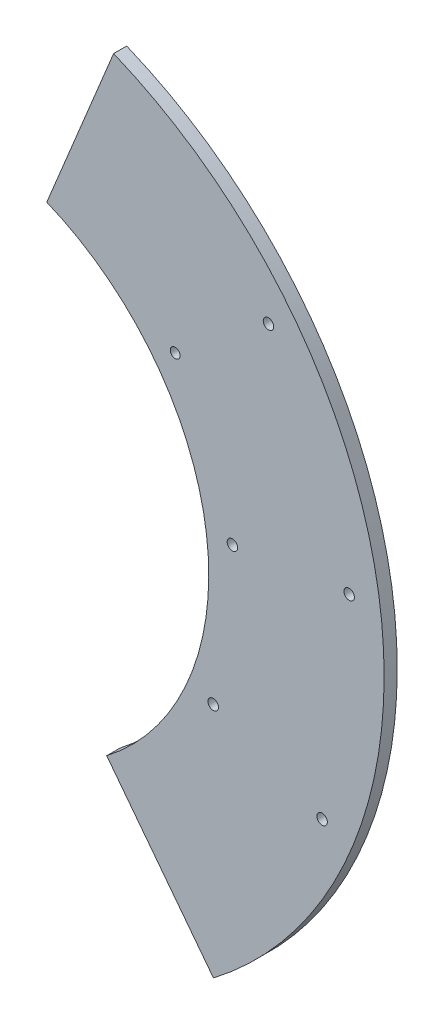
ISO-10303-21;
HEADER;
FILE_DESCRIPTION(('STEP AP214'),'2;1');
FILE_NAME('part.step','',(''),(''),'','','');
FILE_SCHEMA(('AUTOMOTIVE_DESIGN { 1 0 10303 214 1 1 1 1 }'));
ENDSEC;
DATA;
#1=APPLICATION_CONTEXT('core data for automotive mechanical design processes');
#2=APPLICATION_PROTOCOL_DEFINITION('international standard','automotive_design',2000,#1);
#3=PRODUCT_CONTEXT('',#1,'mechanical');
#4=PRODUCT('Part','Part','',(#3));
#5=PRODUCT_RELATED_PRODUCT_CATEGORY('part','',(#4));
#6=PRODUCT_DEFINITION_FORMATION('','',#4);
#7=PRODUCT_DEFINITION_CONTEXT('part definition',#1,'design');
#8=PRODUCT_DEFINITION('design','',#6,#7);
#9=PRODUCT_DEFINITION_SHAPE('','',#8);
#10=(LENGTH_UNIT() NAMED_UNIT(*) SI_UNIT(.MILLI.,.METRE.));
#11=(NAMED_UNIT(*) PLANE_ANGLE_UNIT() SI_UNIT($,.RADIAN.));
#12=(NAMED_UNIT(*) SI_UNIT($,.STERADIAN.) SOLID_ANGLE_UNIT());
#13=UNCERTAINTY_MEASURE_WITH_UNIT(LENGTH_MEASURE(1.E-05),#10,'distance_accuracy_value','');
#14=(GEOMETRIC_REPRESENTATION_CONTEXT(3) GLOBAL_UNCERTAINTY_ASSIGNED_CONTEXT((#13)) GLOBAL_UNIT_ASSIGNED_CONTEXT((#10,
#11,#12)) REPRESENTATION_CONTEXT('',''));
#15=CARTESIAN_POINT('',(0.,0.,0.));
#16=DIRECTION('',(0.,0.,1.));
#17=DIRECTION('',(1.,0.,0.));
#18=AXIS2_PLACEMENT_3D('',#15,#16,#17);
#19=CARTESIAN_POINT('',(0.,0.,5.));
#20=DIRECTION('',(0.,0.,-1.));
#21=DIRECTION('',(-1.,0.,0.));
#22=AXIS2_PLACEMENT_3D('',#19,#20,#21);
#23=CYLINDRICAL_SURFACE('',#22,100.);
#24=DIRECTION('',(0.,0.,1.));
#25=VECTOR('',#24,1.);
#26=CARTESIAN_POINT('',(61.0094832088441,-79.232840152236,-5.));
#27=LINE('',#26,#25);
#28=CARTESIAN_POINT('',(61.0094832088441,-79.232840152236,0.));
#29=VERTEX_POINT('',#28);
#30=CARTESIAN_POINT('',(61.0094832088441,-79.232840152236,5.));
#31=VERTEX_POINT('',#30);
#32=EDGE_CURVE('E91',#29,#31,#27,.T.);
#33=ORIENTED_EDGE('',*,*,#32,.T.);
#34=CARTESIAN_POINT('',(0.,0.,5.));
#35=DIRECTION('',(0.,0.,1.));
#36=DIRECTION('',(1.,0.,0.));
#37=AXIS2_PLACEMENT_3D('',#34,#35,#36);
#38=CIRCLE('',#37,100.);
#39=CARTESIAN_POINT('',(38.1129107813878,92.4521824067446,5.));
#40=VERTEX_POINT('',#39);
#41=EDGE_CURVE('E90',#31,#40,#38,.T.);
#42=ORIENTED_EDGE('',*,*,#41,.T.);
#43=DIRECTION('',(0.,0.,1.));
#44=VECTOR('',#43,1.);
#45=CARTESIAN_POINT('',(38.1129107813878,92.4521824067446,-5.));
#46=LINE('',#45,#44);
#47=CARTESIAN_POINT('',(38.1129107813878,92.4521824067446,0.));
#48=VERTEX_POINT('',#47);
#49=EDGE_CURVE('E140',#48,#40,#46,.T.);
#50=ORIENTED_EDGE('',*,*,#49,.F.);
#51=CARTESIAN_POINT('',(0.,0.,0.));
#52=DIRECTION('',(0.,0.,1.));
#53=DIRECTION('',(1.,0.,0.));
#54=AXIS2_PLACEMENT_3D('',#51,#52,#53);
#55=CIRCLE('',#54,100.);
#56=EDGE_CURVE('E81',#29,#48,#55,.T.);
#57=ORIENTED_EDGE('',*,*,#56,.F.);
#58=EDGE_LOOP('',(#33,#42,#50,#57));
#59=FACE_BOUND('',#58,.T.);
#60=ADVANCED_FACE('F34',(#59),#23,.F.);
#61=CARTESIAN_POINT('',(0.,0.,5.));
#62=DIRECTION('',(0.,0.,-1.));
#63=DIRECTION('',(-1.,0.,0.));
#64=AXIS2_PLACEMENT_3D('',#61,#62,#63);
#65=CYLINDRICAL_SURFACE('',#64,167.);
#66=CARTESIAN_POINT('',(0.,0.,0.));
#67=DIRECTION('',(0.,0.,1.));
#68=DIRECTION('',(1.,0.,0.));
#69=AXIS2_PLACEMENT_3D('',#66,#67,#68);
#70=CIRCLE('',#69,167.);
#71=CARTESIAN_POINT('',(101.798321541105,-132.38618406546,0.));
#72=VERTEX_POINT('',#71);
#73=CARTESIAN_POINT('',(63.6485610049175,154.395144619264,0.));
#74=VERTEX_POINT('',#73);
#75=EDGE_CURVE('E94',#72,#74,#70,.T.);
#76=ORIENTED_EDGE('',*,*,#75,.T.);
#77=DIRECTION('',(0.,0.,1.));
#78=VECTOR('',#77,1.);
#79=CARTESIAN_POINT('',(63.6485610049175,154.395144619264,-5.));
#80=LINE('',#79,#78);
#81=CARTESIAN_POINT('',(63.6485610049175,154.395144619264,5.));
#82=VERTEX_POINT('',#81);
#83=EDGE_CURVE('E50',#74,#82,#80,.T.);
#84=ORIENTED_EDGE('',*,*,#83,.T.);
#85=CARTESIAN_POINT('',(0.,0.,5.));
#86=DIRECTION('',(0.,0.,1.));
#87=DIRECTION('',(1.,0.,0.));
#88=AXIS2_PLACEMENT_3D('',#85,#86,#87);
#89=CIRCLE('',#88,167.);
#90=CARTESIAN_POINT('',(101.798321541105,-132.38618406546,5.));
#91=VERTEX_POINT('',#90);
#92=EDGE_CURVE('E89',#91,#82,#89,.T.);
#93=ORIENTED_EDGE('',*,*,#92,.F.);
#94=DIRECTION('',(0.,0.,1.));
#95=VECTOR('',#94,1.);
#96=CARTESIAN_POINT('',(101.798321541105,-132.38618406546,-5.));
#97=LINE('',#96,#95);
#98=EDGE_CURVE('E42',#72,#91,#97,.T.);
#99=ORIENTED_EDGE('',*,*,#98,.F.);
#100=EDGE_LOOP('',(#76,#84,#93,#99));
#101=FACE_BOUND('',#100,.T.);
#102=ADVANCED_FACE('F93',(#101),#65,.T.);
#103=CARTESIAN_POINT('',(0.,0.,5.));
#104=DIRECTION('',(0.,0.,1.));
#105=DIRECTION('',(1.,0.,0.));
#106=AXIS2_PLACEMENT_3D('',#103,#104,#105);
#107=PLANE('',#106);
#108=DIRECTION('',(-0.608788136708084,0.79333284603847,0.));
#109=VECTOR('',#108,1.);
#110=CARTESIAN_POINT('',(61.0094832088441,-79.232840152236,5.));
#111=LINE('',#110,#109);
#112=EDGE_CURVE('E75',#91,#31,#111,.T.);
#113=ORIENTED_EDGE('',*,*,#112,.F.);
#114=ORIENTED_EDGE('',*,*,#92,.T.);
#115=DIRECTION('',(0.381129107813877,0.924521824067447,0.));
#116=VECTOR('',#115,1.);
#117=CARTESIAN_POINT('',(0.,0.,5.));
#118=LINE('',#117,#116);
#119=EDGE_CURVE('E104',#40,#82,#118,.T.);
#120=ORIENTED_EDGE('',*,*,#119,.F.);
#121=ORIENTED_EDGE('',*,*,#41,.F.);
#122=EDGE_LOOP('',(#113,#114,#120,#121));
#123=FACE_BOUND('',#122,.T.);
#124=CARTESIAN_POINT('',(153.639710684869,20.4899804944849,5.));
#125=DIRECTION('',(0.,0.,1.));
#126=DIRECTION('',(1.,0.,0.));
#127=AXIS2_PLACEMENT_3D('',#124,#125,#126);
#128=CIRCLE('',#127,2.);
#129=CARTESIAN_POINT('',(155.639710684869,20.4899804944849,5.));
#130=VERTEX_POINT('',#129);
#131=EDGE_CURVE('E129',#130,#130,#128,.T.);
#132=ORIENTED_EDGE('',*,*,#131,.F.);
#133=EDGE_LOOP('',(#132));
#134=FACE_BOUND('',#133,.T.);
#135=CARTESIAN_POINT('',(143.300882730434,-59.0750117111726,5.));
#136=DIRECTION('',(0.,0.,1.));
#137=DIRECTION('',(1.,0.,0.));
#138=AXIS2_PLACEMENT_3D('',#135,#136,#137);
#139=CIRCLE('',#138,2.);
#140=CARTESIAN_POINT('',(145.300882730434,-59.0750117111726,5.));
#141=VERTEX_POINT('',#140);
#142=EDGE_CURVE('E119',#141,#141,#139,.T.);
#143=ORIENTED_EDGE('',*,*,#142,.F.);
#144=EDGE_LOOP('',(#143));
#145=FACE_BOUND('',#144,.T.);
#146=CARTESIAN_POINT('',(122.810902235937,94.5646989737124,5.));
#147=DIRECTION('',(0.,0.,1.));
#148=DIRECTION('',(1.,0.,0.));
#149=AXIS2_PLACEMENT_3D('',#146,#147,#148);
#150=CIRCLE('',#149,2.);
#151=CARTESIAN_POINT('',(124.810902235937,94.5646989737124,5.));
#152=VERTEX_POINT('',#151);
#153=EDGE_CURVE('E116',#152,#152,#150,.T.);
#154=ORIENTED_EDGE('',*,*,#153,.F.);
#155=EDGE_LOOP('',(#154));
#156=FACE_BOUND('',#155,.T.);
#157=CARTESIAN_POINT('',(87.1561241674312,67.1104315297325,5.));
#158=DIRECTION('',(0.,0.,1.));
#159=DIRECTION('',(1.,0.,0.));
#160=AXIS2_PLACEMENT_3D('',#157,#158,#159);
#161=CIRCLE('',#160,1.87013138042743);
#162=CARTESIAN_POINT('',(89.0262555478586,67.1104315297325,5.));
#163=VERTEX_POINT('',#162);
#164=EDGE_CURVE('E113',#163,#163,#161,.T.);
#165=ORIENTED_EDGE('',*,*,#164,.F.);
#166=EDGE_LOOP('',(#165));
#167=FACE_BOUND('',#166,.T.);
#168=CARTESIAN_POINT('',(101.697400647403,-41.92420185954,5.));
#169=DIRECTION('',(0.,0.,1.));
#170=DIRECTION('',(1.,0.,0.));
#171=AXIS2_PLACEMENT_3D('',#168,#169,#170);
#172=CIRCLE('',#171,2.);
#173=CARTESIAN_POINT('',(103.697400647403,-41.92420185954,5.));
#174=VERTEX_POINT('',#173);
#175=EDGE_CURVE('E109',#174,#174,#172,.T.);
#176=ORIENTED_EDGE('',*,*,#175,.F.);
#177=EDGE_LOOP('',(#176));
#178=FACE_BOUND('',#177,.T.);
#179=CARTESIAN_POINT('',(109.034633389256,14.5412764799593,5.));
#180=DIRECTION('',(0.,0.,1.));
#181=DIRECTION('',(1.,0.,0.));
#182=AXIS2_PLACEMENT_3D('',#179,#180,#181);
#183=CIRCLE('',#182,2.00000000000001);
#184=CARTESIAN_POINT('',(111.034633389256,14.5412764799593,5.));
#185=VERTEX_POINT('',#184);
#186=EDGE_CURVE('E105',#185,#185,#183,.T.);
#187=ORIENTED_EDGE('',*,*,#186,.F.);
#188=EDGE_LOOP('',(#187));
#189=FACE_BOUND('',#188,.T.);
#190=ADVANCED_FACE('F86',(#123,#134,#145,#156,#167,#178,#189),#107,.T.);
#191=CARTESIAN_POINT('',(0.,0.,0.));
#192=DIRECTION('',(0.,0.,1.));
#193=DIRECTION('',(1.,0.,0.));
#194=AXIS2_PLACEMENT_3D('',#191,#192,#193);
#195=PLANE('',#194);
#196=CARTESIAN_POINT('',(153.639710684869,20.4899804944849,0.));
#197=DIRECTION('',(0.,0.,1.));
#198=DIRECTION('',(1.,0.,0.));
#199=AXIS2_PLACEMENT_3D('',#196,#197,#198);
#200=CIRCLE('',#199,2.);
#201=CARTESIAN_POINT('',(155.639710684869,20.4899804944849,0.));
#202=VERTEX_POINT('',#201);
#203=EDGE_CURVE('E37',#202,#202,#200,.T.);
#204=ORIENTED_EDGE('',*,*,#203,.T.);
#205=EDGE_LOOP('',(#204));
#206=FACE_BOUND('',#205,.T.);
#207=CARTESIAN_POINT('',(143.300882730434,-59.0750117111726,0.));
#208=DIRECTION('',(0.,0.,1.));
#209=DIRECTION('',(1.,0.,0.));
#210=AXIS2_PLACEMENT_3D('',#207,#208,#209);
#211=CIRCLE('',#210,2.);
#212=CARTESIAN_POINT('',(145.300882730434,-59.0750117111726,0.));
#213=VERTEX_POINT('',#212);
#214=EDGE_CURVE('E117',#213,#213,#211,.T.);
#215=ORIENTED_EDGE('',*,*,#214,.T.);
#216=EDGE_LOOP('',(#215));
#217=FACE_BOUND('',#216,.T.);
#218=CARTESIAN_POINT('',(122.810902235937,94.5646989737124,0.));
#219=DIRECTION('',(0.,0.,1.));
#220=DIRECTION('',(1.,0.,0.));
#221=AXIS2_PLACEMENT_3D('',#218,#219,#220);
#222=CIRCLE('',#221,2.);
#223=CARTESIAN_POINT('',(124.810902235937,94.5646989737124,0.));
#224=VERTEX_POINT('',#223);
#225=EDGE_CURVE('E114',#224,#224,#222,.T.);
#226=ORIENTED_EDGE('',*,*,#225,.T.);
#227=EDGE_LOOP('',(#226));
#228=FACE_BOUND('',#227,.T.);
#229=CARTESIAN_POINT('',(87.1561241674312,67.1104315297325,0.));
#230=DIRECTION('',(0.,0.,1.));
#231=DIRECTION('',(1.,0.,0.));
#232=AXIS2_PLACEMENT_3D('',#229,#230,#231);
#233=CIRCLE('',#232,1.87013138042743);
#234=CARTESIAN_POINT('',(89.0262555478586,67.1104315297325,0.));
#235=VERTEX_POINT('',#234);
#236=EDGE_CURVE('E110',#235,#235,#233,.T.);
#237=ORIENTED_EDGE('',*,*,#236,.T.);
#238=EDGE_LOOP('',(#237));
#239=FACE_BOUND('',#238,.T.);
#240=CARTESIAN_POINT('',(101.697400647403,-41.92420185954,0.));
#241=DIRECTION('',(0.,0.,1.));
#242=DIRECTION('',(1.,0.,0.));
#243=AXIS2_PLACEMENT_3D('',#240,#241,#242);
#244=CIRCLE('',#243,2.);
#245=CARTESIAN_POINT('',(103.697400647403,-41.92420185954,0.));
#246=VERTEX_POINT('',#245);
#247=EDGE_CURVE('E106',#246,#246,#244,.T.);
#248=ORIENTED_EDGE('',*,*,#247,.T.);
#249=EDGE_LOOP('',(#248));
#250=FACE_BOUND('',#249,.T.);
#251=CARTESIAN_POINT('',(109.034633389256,14.5412764799593,0.));
#252=DIRECTION('',(0.,0.,1.));
#253=DIRECTION('',(1.,0.,0.));
#254=AXIS2_PLACEMENT_3D('',#251,#252,#253);
#255=CIRCLE('',#254,2.00000000000001);
#256=CARTESIAN_POINT('',(111.034633389256,14.5412764799593,0.));
#257=VERTEX_POINT('',#256);
#258=EDGE_CURVE('E101',#257,#257,#255,.T.);
#259=ORIENTED_EDGE('',*,*,#258,.T.);
#260=EDGE_LOOP('',(#259));
#261=FACE_BOUND('',#260,.T.);
#262=ORIENTED_EDGE('',*,*,#75,.F.);
#263=DIRECTION('',(-0.608788136708084,0.793332846038471,0.));
#264=VECTOR('',#263,1.);
#265=CARTESIAN_POINT('',(0.130752222471672,0.100336702667054,0.));
#266=LINE('',#265,#264);
#267=EDGE_CURVE('E57',#72,#29,#266,.T.);
#268=ORIENTED_EDGE('',*,*,#267,.T.);
#269=ORIENTED_EDGE('',*,*,#56,.T.);
#270=DIRECTION('',(0.381129107813877,0.924521824067446,0.));
#271=VECTOR('',#270,1.);
#272=CARTESIAN_POINT('',(0.,0.,0.));
#273=LINE('',#272,#271);
#274=EDGE_CURVE('E11',#48,#74,#273,.T.);
#275=ORIENTED_EDGE('',*,*,#274,.T.);
#276=EDGE_LOOP('',(#262,#268,#269,#275));
#277=FACE_BOUND('',#276,.T.);
#278=ADVANCED_FACE('F155',(#206,#217,#228,#239,#250,#261,#277),#195,.F.);
#279=CARTESIAN_POINT('',(0.,0.,-5.));
#280=DIRECTION('',(0.924521824067446,-0.381129107813877,0.));
#281=DIRECTION('',(0.381129107813877,0.924521824067446,0.));
#282=AXIS2_PLACEMENT_3D('',#279,#280,#281);
#283=PLANE('',#282);
#284=ORIENTED_EDGE('',*,*,#49,.T.);
#285=ORIENTED_EDGE('',*,*,#119,.T.);
#286=ORIENTED_EDGE('',*,*,#83,.F.);
#287=ORIENTED_EDGE('',*,*,#274,.F.);
#288=EDGE_LOOP('',(#284,#285,#286,#287));
#289=FACE_BOUND('',#288,.T.);
#290=ADVANCED_FACE('F143',(#289),#283,.F.);
#291=CARTESIAN_POINT('',(109.034633389256,14.5412764799593,-5.));
#292=DIRECTION('',(0.,0.,1.));
#293=DIRECTION('',(1.,0.,0.));
#294=AXIS2_PLACEMENT_3D('',#291,#292,#293);
#295=CYLINDRICAL_SURFACE('',#294,2.00000000000001);
#296=ORIENTED_EDGE('',*,*,#186,.T.);
#297=EDGE_LOOP('',(#296));
#298=FACE_BOUND('',#297,.T.);
#299=ORIENTED_EDGE('',*,*,#258,.F.);
#300=EDGE_LOOP('',(#299));
#301=FACE_BOUND('',#300,.T.);
#302=ADVANCED_FACE('F165',(#298,#301),#295,.F.);
#303=CARTESIAN_POINT('',(101.697400647403,-41.92420185954,-5.));
#304=DIRECTION('',(0.,0.,1.));
#305=DIRECTION('',(1.,0.,0.));
#306=AXIS2_PLACEMENT_3D('',#303,#304,#305);
#307=CYLINDRICAL_SURFACE('',#306,2.);
#308=ORIENTED_EDGE('',*,*,#175,.T.);
#309=EDGE_LOOP('',(#308));
#310=FACE_BOUND('',#309,.T.);
#311=ORIENTED_EDGE('',*,*,#247,.F.);
#312=EDGE_LOOP('',(#311));
#313=FACE_BOUND('',#312,.T.);
#314=ADVANCED_FACE('F168',(#310,#313),#307,.F.);
#315=CARTESIAN_POINT('',(87.1561241674312,67.1104315297325,-5.));
#316=DIRECTION('',(0.,0.,1.));
#317=DIRECTION('',(1.,0.,0.));
#318=AXIS2_PLACEMENT_3D('',#315,#316,#317);
#319=CYLINDRICAL_SURFACE('',#318,1.87013138042743);
#320=ORIENTED_EDGE('',*,*,#164,.T.);
#321=EDGE_LOOP('',(#320));
#322=FACE_BOUND('',#321,.T.);
#323=ORIENTED_EDGE('',*,*,#236,.F.);
#324=EDGE_LOOP('',(#323));
#325=FACE_BOUND('',#324,.T.);
#326=ADVANCED_FACE('F191',(#322,#325),#319,.F.);
#327=CARTESIAN_POINT('',(122.810902235937,94.5646989737124,-5.));
#328=DIRECTION('',(0.,0.,1.));
#329=DIRECTION('',(1.,0.,0.));
#330=AXIS2_PLACEMENT_3D('',#327,#328,#329);
#331=CYLINDRICAL_SURFACE('',#330,2.);
#332=ORIENTED_EDGE('',*,*,#153,.T.);
#333=EDGE_LOOP('',(#332));
#334=FACE_BOUND('',#333,.T.);
#335=ORIENTED_EDGE('',*,*,#225,.F.);
#336=EDGE_LOOP('',(#335));
#337=FACE_BOUND('',#336,.T.);
#338=ADVANCED_FACE('F195',(#334,#337),#331,.F.);
#339=CARTESIAN_POINT('',(143.300882730434,-59.0750117111726,-5.));
#340=DIRECTION('',(0.,0.,1.));
#341=DIRECTION('',(1.,0.,0.));
#342=AXIS2_PLACEMENT_3D('',#339,#340,#341);
#343=CYLINDRICAL_SURFACE('',#342,2.);
#344=ORIENTED_EDGE('',*,*,#142,.T.);
#345=EDGE_LOOP('',(#344));
#346=FACE_BOUND('',#345,.T.);
#347=ORIENTED_EDGE('',*,*,#214,.F.);
#348=EDGE_LOOP('',(#347));
#349=FACE_BOUND('',#348,.T.);
#350=ADVANCED_FACE('F199',(#346,#349),#343,.F.);
#351=CARTESIAN_POINT('',(153.639710684869,20.4899804944849,-5.));
#352=DIRECTION('',(0.,0.,1.));
#353=DIRECTION('',(1.,0.,0.));
#354=AXIS2_PLACEMENT_3D('',#351,#352,#353);
#355=CYLINDRICAL_SURFACE('',#354,2.);
#356=ORIENTED_EDGE('',*,*,#131,.T.);
#357=EDGE_LOOP('',(#356));
#358=FACE_BOUND('',#357,.T.);
#359=ORIENTED_EDGE('',*,*,#203,.F.);
#360=EDGE_LOOP('',(#359));
#361=FACE_BOUND('',#360,.T.);
#362=ADVANCED_FACE('F151',(#358,#361),#355,.F.);
#363=CARTESIAN_POINT('',(61.0094832088441,-79.232840152236,-5.));
#364=DIRECTION('',(0.793332846038471,0.608788136708084,0.));
#365=DIRECTION('',(-0.608788136708084,0.793332846038471,0.));
#366=AXIS2_PLACEMENT_3D('',#363,#364,#365);
#367=PLANE('',#366);
#368=ORIENTED_EDGE('',*,*,#98,.T.);
#369=ORIENTED_EDGE('',*,*,#112,.T.);
#370=ORIENTED_EDGE('',*,*,#32,.F.);
#371=ORIENTED_EDGE('',*,*,#267,.F.);
#372=EDGE_LOOP('',(#368,#369,#370,#371));
#373=FACE_BOUND('',#372,.T.);
#374=ADVANCED_FACE('F74',(#373),#367,.F.);
#375=CLOSED_SHELL('',(#60,#102,#190,#278,#290,#302,#314,#326,#338,#350,#362,#374));
#376=MANIFOLD_SOLID_BREP('B2',#375);
#377=ADVANCED_BREP_SHAPE_REPRESENTATION('',(#18,#376),#14);
#378=SHAPE_DEFINITION_REPRESENTATION(#9,#377);
ENDSEC;
END-ISO-10303-21;
